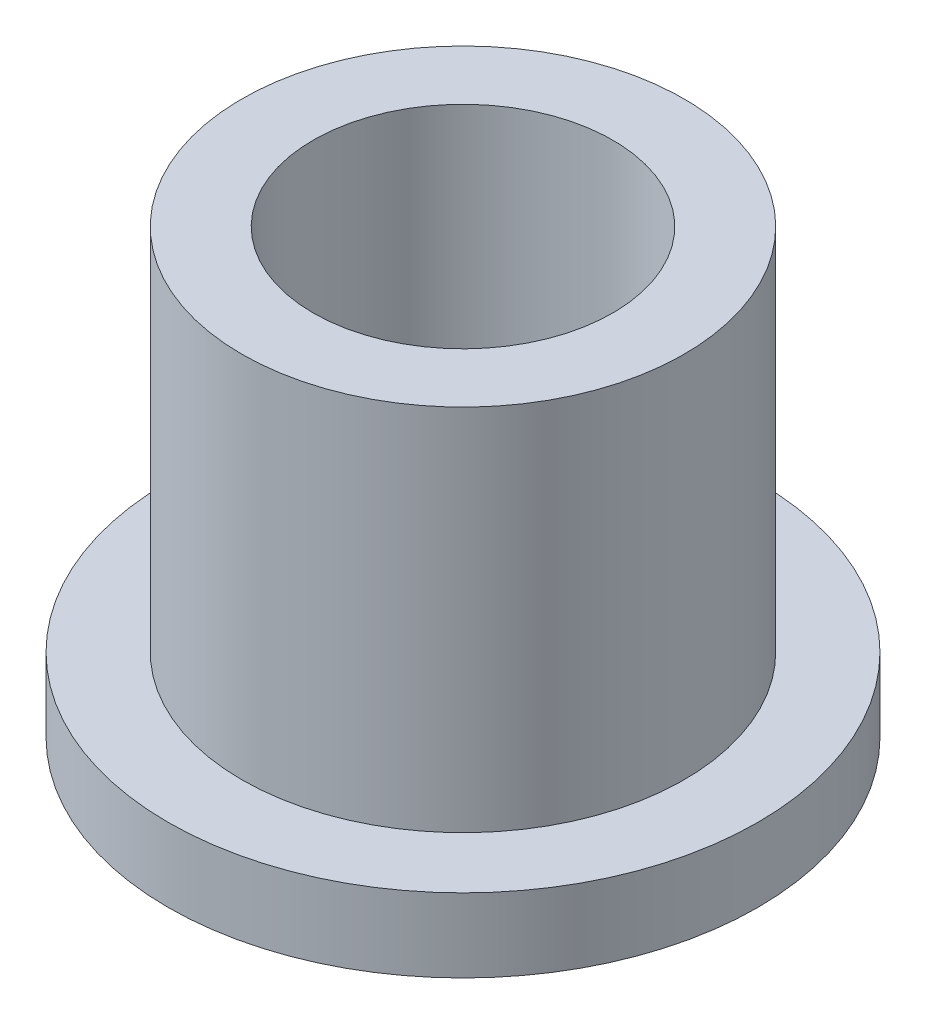
ISO-10303-21;
HEADER;
FILE_DESCRIPTION(('STEP AP214'),'2;1');
FILE_NAME('part.step','',(''),(''),'','','');
FILE_SCHEMA(('AUTOMOTIVE_DESIGN { 1 0 10303 214 1 1 1 1 }'));
ENDSEC;
DATA;
#1=APPLICATION_CONTEXT('core data for automotive mechanical design processes');
#2=APPLICATION_PROTOCOL_DEFINITION('international standard','automotive_design',2000,#1);
#3=PRODUCT_CONTEXT('',#1,'mechanical');
#4=PRODUCT('Part','Part','',(#3));
#5=PRODUCT_RELATED_PRODUCT_CATEGORY('part','',(#4));
#6=PRODUCT_DEFINITION_FORMATION('','',#4);
#7=PRODUCT_DEFINITION_CONTEXT('part definition',#1,'design');
#8=PRODUCT_DEFINITION('design','',#6,#7);
#9=PRODUCT_DEFINITION_SHAPE('','',#8);
#10=(LENGTH_UNIT() NAMED_UNIT(*) SI_UNIT(.MILLI.,.METRE.));
#11=(NAMED_UNIT(*) PLANE_ANGLE_UNIT() SI_UNIT($,.RADIAN.));
#12=(NAMED_UNIT(*) SI_UNIT($,.STERADIAN.) SOLID_ANGLE_UNIT());
#13=UNCERTAINTY_MEASURE_WITH_UNIT(LENGTH_MEASURE(1.E-05),#10,'distance_accuracy_value','');
#14=(GEOMETRIC_REPRESENTATION_CONTEXT(3) GLOBAL_UNCERTAINTY_ASSIGNED_CONTEXT((#13)) GLOBAL_UNIT_ASSIGNED_CONTEXT((#10,
#11,#12)) REPRESENTATION_CONTEXT('',''));
#15=CARTESIAN_POINT('',(0.,0.,0.));
#16=DIRECTION('',(0.,0.,1.));
#17=DIRECTION('',(1.,0.,0.));
#18=AXIS2_PLACEMENT_3D('',#15,#16,#17);
#19=CARTESIAN_POINT('',(0.,9.525,0.));
#20=DIRECTION('',(0.,1.,0.));
#21=DIRECTION('',(0.,0.,1.));
#22=AXIS2_PLACEMENT_3D('',#19,#20,#21);
#23=PLANE('',#22);
#24=CARTESIAN_POINT('',(0.,9.525,0.));
#25=DIRECTION('',(0.,1.,0.));
#26=DIRECTION('',(0.,0.,1.));
#27=AXIS2_PLACEMENT_3D('',#24,#25,#26);
#28=CIRCLE('',#27,4.7625);
#29=CARTESIAN_POINT('',(0.,9.525,4.7625));
#30=VERTEX_POINT('',#29);
#31=EDGE_CURVE('E10',#30,#30,#28,.T.);
#32=ORIENTED_EDGE('',*,*,#31,.T.);
#33=EDGE_LOOP('',(#32));
#34=FACE_BOUND('',#33,.T.);
#35=CARTESIAN_POINT('',(0.,9.525,0.));
#36=DIRECTION('',(0.,1.,0.));
#37=DIRECTION('',(0.,0.,1.));
#38=AXIS2_PLACEMENT_3D('',#35,#36,#37);
#39=CIRCLE('',#38,3.2258);
#40=CARTESIAN_POINT('',(0.,9.525,3.2258));
#41=VERTEX_POINT('',#40);
#42=EDGE_CURVE('E42',#41,#41,#39,.T.);
#43=ORIENTED_EDGE('',*,*,#42,.F.);
#44=EDGE_LOOP('',(#43));
#45=FACE_BOUND('',#44,.T.);
#46=ADVANCED_FACE('F35',(#34,#45),#23,.T.);
#47=CARTESIAN_POINT('',(0.,0.,0.));
#48=DIRECTION('',(0.,1.,0.));
#49=DIRECTION('',(0.,0.,1.));
#50=AXIS2_PLACEMENT_3D('',#47,#48,#49);
#51=PLANE('',#50);
#52=CARTESIAN_POINT('',(0.,0.,0.));
#53=DIRECTION('',(0.,1.,0.));
#54=DIRECTION('',(0.,0.,1.));
#55=AXIS2_PLACEMENT_3D('',#52,#53,#54);
#56=CIRCLE('',#55,3.2258);
#57=CARTESIAN_POINT('',(0.,0.,3.2258));
#58=VERTEX_POINT('',#57);
#59=EDGE_CURVE('E46',#58,#58,#56,.T.);
#60=ORIENTED_EDGE('',*,*,#59,.T.);
#61=EDGE_LOOP('',(#60));
#62=FACE_BOUND('',#61,.T.);
#63=CARTESIAN_POINT('',(0.,0.,0.));
#64=DIRECTION('',(0.,1.,0.));
#65=DIRECTION('',(0.,0.,1.));
#66=AXIS2_PLACEMENT_3D('',#63,#64,#65);
#67=CIRCLE('',#66,6.35);
#68=CARTESIAN_POINT('',(0.,0.,6.35));
#69=VERTEX_POINT('',#68);
#70=EDGE_CURVE('E53',#69,#69,#67,.T.);
#71=ORIENTED_EDGE('',*,*,#70,.F.);
#72=EDGE_LOOP('',(#71));
#73=FACE_BOUND('',#72,.T.);
#74=ADVANCED_FACE('F78',(#62,#73),#51,.F.);
#75=CARTESIAN_POINT('',(0.,9.525,0.));
#76=DIRECTION('',(0.,-1.,0.));
#77=DIRECTION('',(0.,0.,-1.));
#78=AXIS2_PLACEMENT_3D('',#75,#76,#77);
#79=CYLINDRICAL_SURFACE('',#78,4.7625);
#80=CARTESIAN_POINT('',(0.,1.5875,0.));
#81=DIRECTION('',(0.,1.,0.));
#82=DIRECTION('',(0.,0.,1.));
#83=AXIS2_PLACEMENT_3D('',#80,#81,#82);
#84=CIRCLE('',#83,4.7625);
#85=CARTESIAN_POINT('',(0.,1.5875,4.7625));
#86=VERTEX_POINT('',#85);
#87=EDGE_CURVE('E56',#86,#86,#84,.T.);
#88=ORIENTED_EDGE('',*,*,#87,.T.);
#89=EDGE_LOOP('',(#88));
#90=FACE_BOUND('',#89,.T.);
#91=ORIENTED_EDGE('',*,*,#31,.F.);
#92=EDGE_LOOP('',(#91));
#93=FACE_BOUND('',#92,.T.);
#94=ADVANCED_FACE('F37',(#90,#93),#79,.T.);
#95=CARTESIAN_POINT('',(0.,9.525,0.));
#96=DIRECTION('',(0.,-1.,0.));
#97=DIRECTION('',(0.,0.,-1.));
#98=AXIS2_PLACEMENT_3D('',#95,#96,#97);
#99=CYLINDRICAL_SURFACE('',#98,3.2258);
#100=ORIENTED_EDGE('',*,*,#42,.T.);
#101=EDGE_LOOP('',(#100));
#102=FACE_BOUND('',#101,.T.);
#103=ORIENTED_EDGE('',*,*,#59,.F.);
#104=EDGE_LOOP('',(#103));
#105=FACE_BOUND('',#104,.T.);
#106=ADVANCED_FACE('F67',(#102,#105),#99,.F.);
#107=CARTESIAN_POINT('',(0.,1.5875,0.));
#108=DIRECTION('',(0.,1.,0.));
#109=DIRECTION('',(0.,0.,1.));
#110=AXIS2_PLACEMENT_3D('',#107,#108,#109);
#111=PLANE('',#110);
#112=CARTESIAN_POINT('',(0.,1.5875,0.));
#113=DIRECTION('',(0.,1.,0.));
#114=DIRECTION('',(0.,0.,1.));
#115=AXIS2_PLACEMENT_3D('',#112,#113,#114);
#116=CIRCLE('',#115,6.35);
#117=CARTESIAN_POINT('',(0.,1.5875,6.35));
#118=VERTEX_POINT('',#117);
#119=EDGE_CURVE('E51',#118,#118,#116,.T.);
#120=ORIENTED_EDGE('',*,*,#119,.T.);
#121=EDGE_LOOP('',(#120));
#122=FACE_BOUND('',#121,.T.);
#123=ORIENTED_EDGE('',*,*,#87,.F.);
#124=EDGE_LOOP('',(#123));
#125=FACE_BOUND('',#124,.T.);
#126=ADVANCED_FACE('F64',(#122,#125),#111,.T.);
#127=CARTESIAN_POINT('',(0.,1.5875,0.));
#128=DIRECTION('',(0.,-1.,0.));
#129=DIRECTION('',(0.,0.,-1.));
#130=AXIS2_PLACEMENT_3D('',#127,#128,#129);
#131=CYLINDRICAL_SURFACE('',#130,6.35);
#132=ORIENTED_EDGE('',*,*,#119,.F.);
#133=EDGE_LOOP('',(#132));
#134=FACE_BOUND('',#133,.T.);
#135=ORIENTED_EDGE('',*,*,#70,.T.);
#136=EDGE_LOOP('',(#135));
#137=FACE_BOUND('',#136,.T.);
#138=ADVANCED_FACE('F66',(#134,#137),#131,.T.);
#139=CLOSED_SHELL('',(#46,#74,#94,#106,#126,#138));
#140=MANIFOLD_SOLID_BREP('B2',#139);
#141=ADVANCED_BREP_SHAPE_REPRESENTATION('',(#18,#140),#14);
#142=SHAPE_DEFINITION_REPRESENTATION(#9,#141);
ENDSEC;
END-ISO-10303-21;
